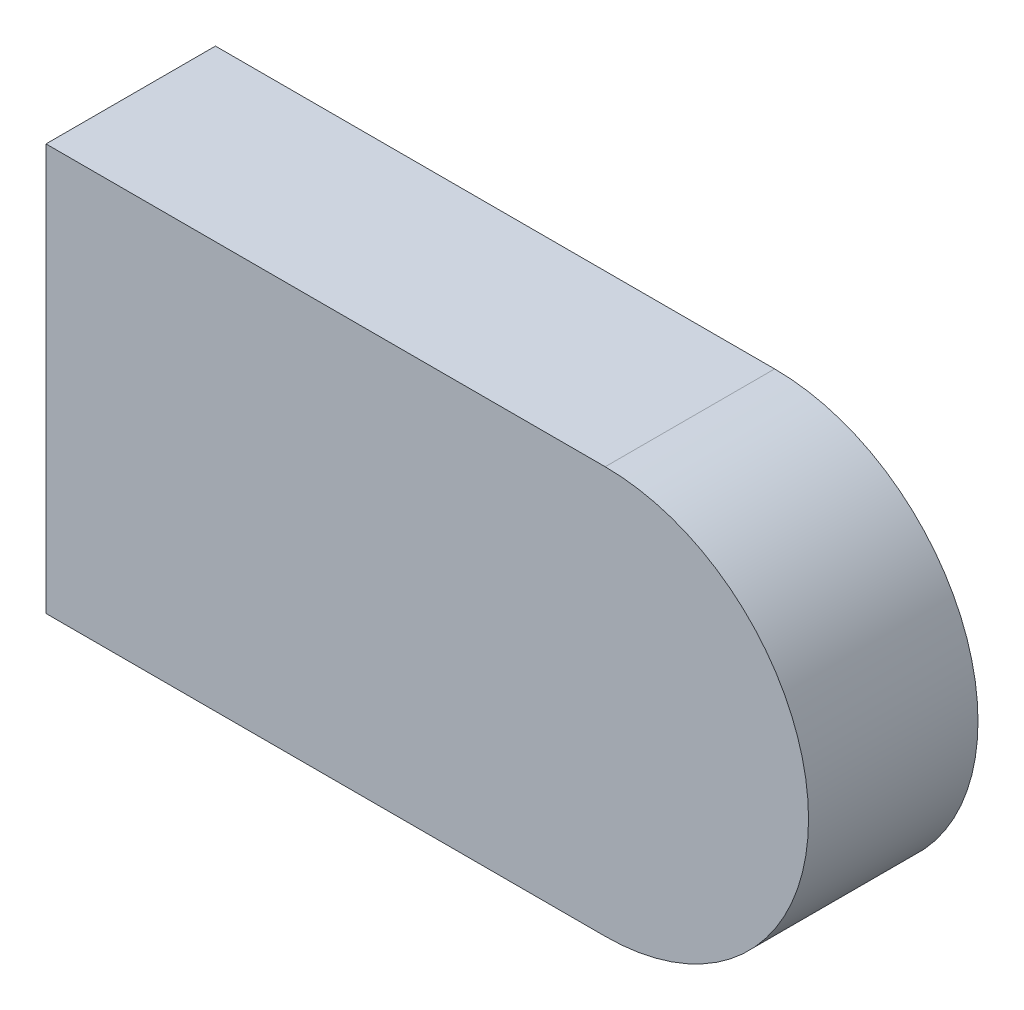
ISO-10303-21;
HEADER;
FILE_DESCRIPTION(('STEP AP214'),'2;1');
FILE_NAME('part.step','',(''),(''),'','','');
FILE_SCHEMA(('AUTOMOTIVE_DESIGN { 1 0 10303 214 1 1 1 1 }'));
ENDSEC;
DATA;
#1=APPLICATION_CONTEXT('core data for automotive mechanical design processes');
#2=APPLICATION_PROTOCOL_DEFINITION('international standard','automotive_design',2000,#1);
#3=PRODUCT_CONTEXT('',#1,'mechanical');
#4=PRODUCT('Part','Part','',(#3));
#5=PRODUCT_RELATED_PRODUCT_CATEGORY('part','',(#4));
#6=PRODUCT_DEFINITION_FORMATION('','',#4);
#7=PRODUCT_DEFINITION_CONTEXT('part definition',#1,'design');
#8=PRODUCT_DEFINITION('design','',#6,#7);
#9=PRODUCT_DEFINITION_SHAPE('','',#8);
#10=(LENGTH_UNIT() NAMED_UNIT(*) SI_UNIT(.MILLI.,.METRE.));
#11=(NAMED_UNIT(*) PLANE_ANGLE_UNIT() SI_UNIT($,.RADIAN.));
#12=(NAMED_UNIT(*) SI_UNIT($,.STERADIAN.) SOLID_ANGLE_UNIT());
#13=UNCERTAINTY_MEASURE_WITH_UNIT(LENGTH_MEASURE(1.E-05),#10,'distance_accuracy_value','');
#14=(GEOMETRIC_REPRESENTATION_CONTEXT(3) GLOBAL_UNCERTAINTY_ASSIGNED_CONTEXT((#13)) GLOBAL_UNIT_ASSIGNED_CONTEXT((#10,
#11,#12)) REPRESENTATION_CONTEXT('',''));
#15=CARTESIAN_POINT('',(0.,0.,0.));
#16=DIRECTION('',(0.,0.,1.));
#17=DIRECTION('',(1.,0.,0.));
#18=AXIS2_PLACEMENT_3D('',#15,#16,#17);
#19=CARTESIAN_POINT('',(-4.05,3.13,0.));
#20=DIRECTION('',(0.,1.,0.));
#21=DIRECTION('',(1.,0.,0.));
#22=AXIS2_PLACEMENT_3D('',#19,#20,#21);
#23=PLANE('',#22);
#24=DIRECTION('',(1.,0.,0.));
#25=VECTOR('',#24,1.);
#26=CARTESIAN_POINT('',(-4.05,3.13,0.));
#27=LINE('',#26,#25);
#28=CARTESIAN_POINT('',(-4.05,3.13,0.));
#29=VERTEX_POINT('',#28);
#30=CARTESIAN_POINT('',(-3.72,3.13,0.));
#31=VERTEX_POINT('',#30);
#32=EDGE_CURVE('E11',#29,#31,#27,.T.);
#33=ORIENTED_EDGE('',*,*,#32,.T.);
#34=DIRECTION('',(0.,0.,1.));
#35=VECTOR('',#34,1.);
#36=CARTESIAN_POINT('',(-3.72,3.13,0.));
#37=LINE('',#36,#35);
#38=CARTESIAN_POINT('',(-3.72,3.13,0.1));
#39=VERTEX_POINT('',#38);
#40=EDGE_CURVE('E24',#31,#39,#37,.T.);
#41=ORIENTED_EDGE('',*,*,#40,.T.);
#42=DIRECTION('',(1.,0.,0.));
#43=VECTOR('',#42,1.);
#44=CARTESIAN_POINT('',(-4.05,3.13,0.1));
#45=LINE('',#44,#43);
#46=CARTESIAN_POINT('',(-4.05,3.13,0.1));
#47=VERTEX_POINT('',#46);
#48=EDGE_CURVE('E88',#47,#39,#45,.T.);
#49=ORIENTED_EDGE('',*,*,#48,.F.);
#50=DIRECTION('',(0.,0.,1.));
#51=VECTOR('',#50,1.);
#52=CARTESIAN_POINT('',(-4.05,3.13,0.));
#53=LINE('',#52,#51);
#54=EDGE_CURVE('E36',#29,#47,#53,.T.);
#55=ORIENTED_EDGE('',*,*,#54,.F.);
#56=EDGE_LOOP('',(#33,#41,#49,#55));
#57=FACE_BOUND('',#56,.T.);
#58=ADVANCED_FACE('F17',(#57),#23,.F.);
#59=CARTESIAN_POINT('',(-3.72,3.25,0.));
#60=DIRECTION('',(0.,0.,-1.));
#61=DIRECTION('',(1.,0.,0.));
#62=AXIS2_PLACEMENT_3D('',#59,#60,#61);
#63=CYLINDRICAL_SURFACE('',#62,0.12);
#64=CARTESIAN_POINT('',(-3.72,3.25,0.));
#65=DIRECTION('',(0.,0.,1.));
#66=DIRECTION('',(1.,0.,0.));
#67=AXIS2_PLACEMENT_3D('',#64,#65,#66);
#68=CIRCLE('',#67,0.12);
#69=CARTESIAN_POINT('',(-3.72,3.37,0.));
#70=VERTEX_POINT('',#69);
#71=EDGE_CURVE('E85',#31,#70,#68,.T.);
#72=ORIENTED_EDGE('',*,*,#71,.T.);
#73=DIRECTION('',(0.,0.,1.));
#74=VECTOR('',#73,1.);
#75=CARTESIAN_POINT('',(-3.72,3.37,0.));
#76=LINE('',#75,#74);
#77=CARTESIAN_POINT('',(-3.72,3.37,0.1));
#78=VERTEX_POINT('',#77);
#79=EDGE_CURVE('E73',#70,#78,#76,.T.);
#80=ORIENTED_EDGE('',*,*,#79,.T.);
#81=CARTESIAN_POINT('',(-3.72,3.25,0.1));
#82=DIRECTION('',(0.,0.,1.));
#83=DIRECTION('',(1.,0.,0.));
#84=AXIS2_PLACEMENT_3D('',#81,#82,#83);
#85=CIRCLE('',#84,0.12);
#86=EDGE_CURVE('E66',#39,#78,#85,.T.);
#87=ORIENTED_EDGE('',*,*,#86,.F.);
#88=ORIENTED_EDGE('',*,*,#40,.F.);
#89=EDGE_LOOP('',(#72,#80,#87,#88));
#90=FACE_BOUND('',#89,.T.);
#91=ADVANCED_FACE('F89',(#90),#63,.T.);
#92=CARTESIAN_POINT('',(-4.05,3.37,0.));
#93=DIRECTION('',(0.,1.,0.));
#94=DIRECTION('',(1.,0.,0.));
#95=AXIS2_PLACEMENT_3D('',#92,#93,#94);
#96=PLANE('',#95);
#97=DIRECTION('',(0.,0.,1.));
#98=VECTOR('',#97,1.);
#99=CARTESIAN_POINT('',(-4.05,3.37,0.));
#100=LINE('',#99,#98);
#101=CARTESIAN_POINT('',(-4.05,3.37,0.));
#102=VERTEX_POINT('',#101);
#103=CARTESIAN_POINT('',(-4.05,3.37,0.1));
#104=VERTEX_POINT('',#103);
#105=EDGE_CURVE('E56',#102,#104,#100,.T.);
#106=ORIENTED_EDGE('',*,*,#105,.T.);
#107=DIRECTION('',(1.,0.,0.));
#108=VECTOR('',#107,1.);
#109=CARTESIAN_POINT('',(-4.05,3.37,0.1));
#110=LINE('',#109,#108);
#111=EDGE_CURVE('E67',#104,#78,#110,.T.);
#112=ORIENTED_EDGE('',*,*,#111,.T.);
#113=ORIENTED_EDGE('',*,*,#79,.F.);
#114=DIRECTION('',(1.,0.,0.));
#115=VECTOR('',#114,1.);
#116=CARTESIAN_POINT('',(-4.05,3.37,0.));
#117=LINE('',#116,#115);
#118=EDGE_CURVE('E71',#102,#70,#117,.T.);
#119=ORIENTED_EDGE('',*,*,#118,.F.);
#120=EDGE_LOOP('',(#106,#112,#113,#119));
#121=FACE_BOUND('',#120,.T.);
#122=ADVANCED_FACE('F72',(#121),#96,.T.);
#123=CARTESIAN_POINT('',(-4.05,3.13,0.));
#124=DIRECTION('',(-1.,0.,0.));
#125=DIRECTION('',(0.,1.,0.));
#126=AXIS2_PLACEMENT_3D('',#123,#124,#125);
#127=PLANE('',#126);
#128=ORIENTED_EDGE('',*,*,#54,.T.);
#129=DIRECTION('',(0.,1.,0.));
#130=VECTOR('',#129,1.);
#131=CARTESIAN_POINT('',(-4.05,3.13,0.1));
#132=LINE('',#131,#130);
#133=EDGE_CURVE('E62',#47,#104,#132,.T.);
#134=ORIENTED_EDGE('',*,*,#133,.T.);
#135=ORIENTED_EDGE('',*,*,#105,.F.);
#136=DIRECTION('',(0.,1.,0.));
#137=VECTOR('',#136,1.);
#138=CARTESIAN_POINT('',(-4.05,3.13,0.));
#139=LINE('',#138,#137);
#140=EDGE_CURVE('E60',#29,#102,#139,.T.);
#141=ORIENTED_EDGE('',*,*,#140,.F.);
#142=EDGE_LOOP('',(#128,#134,#135,#141));
#143=FACE_BOUND('',#142,.T.);
#144=ADVANCED_FACE('F58',(#143),#127,.T.);
#145=CARTESIAN_POINT('',(-3.849490847913,3.25,0.));
#146=DIRECTION('',(0.,0.,1.));
#147=DIRECTION('',(1.,0.,0.));
#148=AXIS2_PLACEMENT_3D('',#145,#146,#147);
#149=PLANE('',#148);
#150=ORIENTED_EDGE('',*,*,#140,.T.);
#151=ORIENTED_EDGE('',*,*,#118,.T.);
#152=ORIENTED_EDGE('',*,*,#71,.F.);
#153=ORIENTED_EDGE('',*,*,#32,.F.);
#154=EDGE_LOOP('',(#150,#151,#152,#153));
#155=FACE_BOUND('',#154,.T.);
#156=ADVANCED_FACE('F77',(#155),#149,.F.);
#157=CARTESIAN_POINT('',(-3.849490847913,3.25,0.1));
#158=DIRECTION('',(0.,0.,1.));
#159=DIRECTION('',(1.,0.,0.));
#160=AXIS2_PLACEMENT_3D('',#157,#158,#159);
#161=PLANE('',#160);
#162=ORIENTED_EDGE('',*,*,#48,.T.);
#163=ORIENTED_EDGE('',*,*,#86,.T.);
#164=ORIENTED_EDGE('',*,*,#111,.F.);
#165=ORIENTED_EDGE('',*,*,#133,.F.);
#166=EDGE_LOOP('',(#162,#163,#164,#165));
#167=FACE_BOUND('',#166,.T.);
#168=ADVANCED_FACE('F91',(#167),#161,.T.);
#169=CLOSED_SHELL('',(#58,#91,#122,#144,#156,#168));
#170=MANIFOLD_SOLID_BREP('B1',#169);
#171=ADVANCED_BREP_SHAPE_REPRESENTATION('',(#18,#170),#14);
#172=SHAPE_DEFINITION_REPRESENTATION(#9,#171);
ENDSEC;
END-ISO-10303-21;
